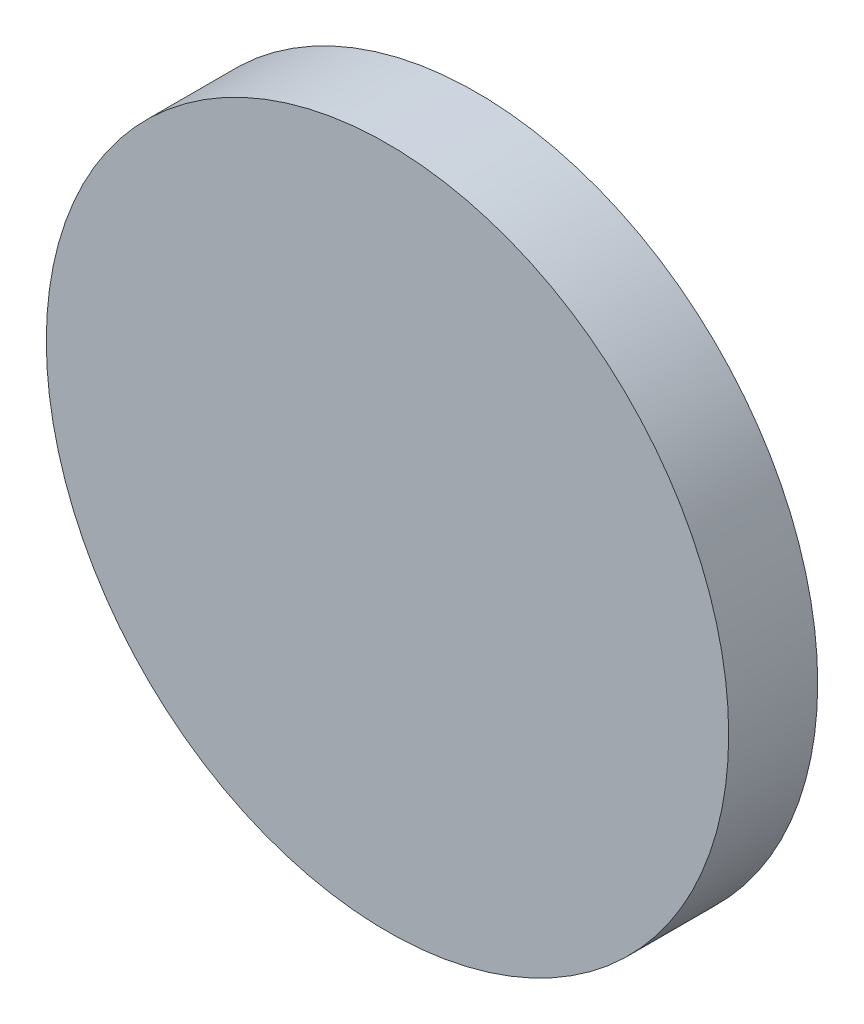
ISO-10303-21;
HEADER;
FILE_DESCRIPTION(('STEP AP214'),'2;1');
FILE_NAME('part.step','',(''),(''),'','','');
FILE_SCHEMA(('AUTOMOTIVE_DESIGN { 1 0 10303 214 1 1 1 1 }'));
ENDSEC;
DATA;
#1=APPLICATION_CONTEXT('core data for automotive mechanical design processes');
#2=APPLICATION_PROTOCOL_DEFINITION('international standard','automotive_design',2000,#1);
#3=PRODUCT_CONTEXT('',#1,'mechanical');
#4=PRODUCT('Part','Part','',(#3));
#5=PRODUCT_RELATED_PRODUCT_CATEGORY('part','',(#4));
#6=PRODUCT_DEFINITION_FORMATION('','',#4);
#7=PRODUCT_DEFINITION_CONTEXT('part definition',#1,'design');
#8=PRODUCT_DEFINITION('design','',#6,#7);
#9=PRODUCT_DEFINITION_SHAPE('','',#8);
#10=(LENGTH_UNIT() NAMED_UNIT(*) SI_UNIT(.MILLI.,.METRE.));
#11=(NAMED_UNIT(*) PLANE_ANGLE_UNIT() SI_UNIT($,.RADIAN.));
#12=(NAMED_UNIT(*) SI_UNIT($,.STERADIAN.) SOLID_ANGLE_UNIT());
#13=UNCERTAINTY_MEASURE_WITH_UNIT(LENGTH_MEASURE(1.E-05),#10,'distance_accuracy_value','');
#14=(GEOMETRIC_REPRESENTATION_CONTEXT(3) GLOBAL_UNCERTAINTY_ASSIGNED_CONTEXT((#13)) GLOBAL_UNIT_ASSIGNED_CONTEXT((#10,
#11,#12)) REPRESENTATION_CONTEXT('',''));
#15=CARTESIAN_POINT('',(0.,0.,0.));
#16=DIRECTION('',(0.,0.,1.));
#17=DIRECTION('',(1.,0.,0.));
#18=AXIS2_PLACEMENT_3D('',#15,#16,#17);
#19=CARTESIAN_POINT('',(0.,0.,3.));
#20=DIRECTION('',(0.,0.,-1.));
#21=DIRECTION('',(-1.,0.,0.));
#22=AXIS2_PLACEMENT_3D('',#19,#20,#21);
#23=CYLINDRICAL_SURFACE('',#22,11.5);
#24=CARTESIAN_POINT('',(0.,0.,3.));
#25=DIRECTION('',(0.,0.,1.));
#26=DIRECTION('',(1.,0.,0.));
#27=AXIS2_PLACEMENT_3D('',#24,#25,#26);
#28=CIRCLE('',#27,11.5);
#29=CARTESIAN_POINT('',(11.5,0.,3.));
#30=VERTEX_POINT('',#29);
#31=EDGE_CURVE('E10',#30,#30,#28,.T.);
#32=ORIENTED_EDGE('',*,*,#31,.F.);
#33=EDGE_LOOP('',(#32));
#34=FACE_BOUND('',#33,.T.);
#35=CARTESIAN_POINT('',(0.,0.,0.));
#36=DIRECTION('',(0.,0.,1.));
#37=DIRECTION('',(1.,0.,0.));
#38=AXIS2_PLACEMENT_3D('',#35,#36,#37);
#39=CIRCLE('',#38,11.5);
#40=CARTESIAN_POINT('',(11.5,0.,0.));
#41=VERTEX_POINT('',#40);
#42=EDGE_CURVE('E40',#41,#41,#39,.T.);
#43=ORIENTED_EDGE('',*,*,#42,.T.);
#44=EDGE_LOOP('',(#43));
#45=FACE_BOUND('',#44,.T.);
#46=ADVANCED_FACE('F37',(#34,#45),#23,.T.);
#47=CARTESIAN_POINT('',(0.,0.,3.));
#48=DIRECTION('',(0.,0.,1.));
#49=DIRECTION('',(1.,0.,0.));
#50=AXIS2_PLACEMENT_3D('',#47,#48,#49);
#51=PLANE('',#50);
#52=ORIENTED_EDGE('',*,*,#31,.T.);
#53=EDGE_LOOP('',(#52));
#54=FACE_BOUND('',#53,.T.);
#55=ADVANCED_FACE('F54',(#54),#51,.T.);
#56=CARTESIAN_POINT('',(0.,0.,0.));
#57=DIRECTION('',(0.,0.,1.));
#58=DIRECTION('',(1.,0.,0.));
#59=AXIS2_PLACEMENT_3D('',#56,#57,#58);
#60=PLANE('',#59);
#61=ORIENTED_EDGE('',*,*,#42,.F.);
#62=EDGE_LOOP('',(#61));
#63=FACE_BOUND('',#62,.T.);
#64=ADVANCED_FACE('F52',(#63),#60,.F.);
#65=CLOSED_SHELL('',(#46,#55,#64));
#66=MANIFOLD_SOLID_BREP('B2',#65);
#67=ADVANCED_BREP_SHAPE_REPRESENTATION('',(#18,#66),#14);
#68=SHAPE_DEFINITION_REPRESENTATION(#9,#67);
ENDSEC;
END-ISO-10303-21;
